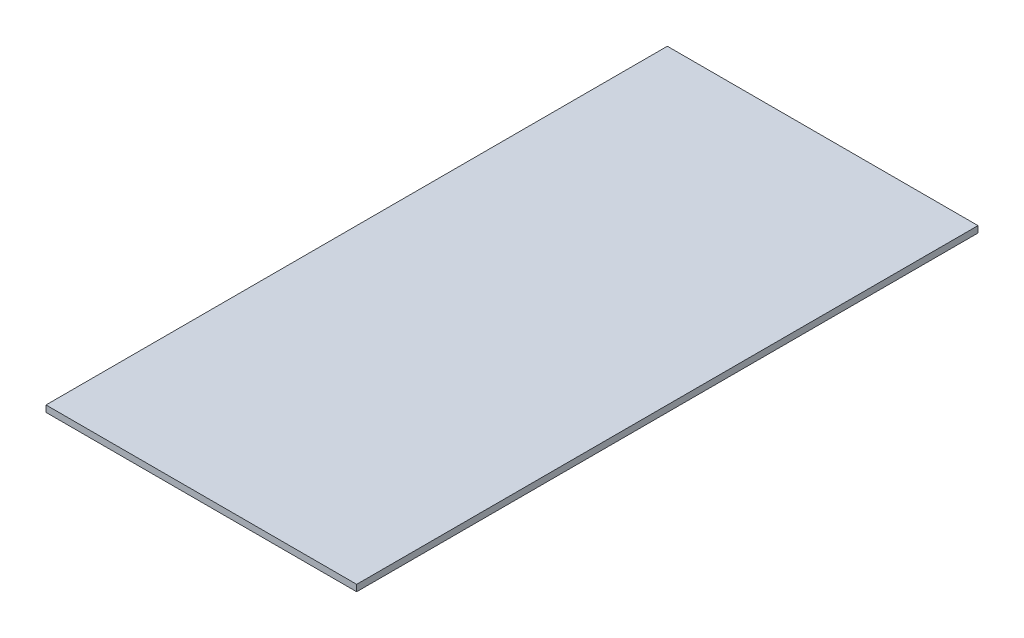
ISO-10303-21;
HEADER;
FILE_DESCRIPTION(('STEP AP214'),'2;1');
FILE_NAME('part.step','',(''),(''),'','','');
FILE_SCHEMA(('AUTOMOTIVE_DESIGN { 1 0 10303 214 1 1 1 1 }'));
ENDSEC;
DATA;
#1=APPLICATION_CONTEXT('core data for automotive mechanical design processes');
#2=APPLICATION_PROTOCOL_DEFINITION('international standard','automotive_design',2000,#1);
#3=PRODUCT_CONTEXT('',#1,'mechanical');
#4=PRODUCT('Part','Part','',(#3));
#5=PRODUCT_RELATED_PRODUCT_CATEGORY('part','',(#4));
#6=PRODUCT_DEFINITION_FORMATION('','',#4);
#7=PRODUCT_DEFINITION_CONTEXT('part definition',#1,'design');
#8=PRODUCT_DEFINITION('design','',#6,#7);
#9=PRODUCT_DEFINITION_SHAPE('','',#8);
#10=(LENGTH_UNIT() NAMED_UNIT(*) SI_UNIT(.MILLI.,.METRE.));
#11=(NAMED_UNIT(*) PLANE_ANGLE_UNIT() SI_UNIT($,.RADIAN.));
#12=(NAMED_UNIT(*) SI_UNIT($,.STERADIAN.) SOLID_ANGLE_UNIT());
#13=UNCERTAINTY_MEASURE_WITH_UNIT(LENGTH_MEASURE(1.E-05),#10,'distance_accuracy_value','');
#14=(GEOMETRIC_REPRESENTATION_CONTEXT(3) GLOBAL_UNCERTAINTY_ASSIGNED_CONTEXT((#13)) GLOBAL_UNIT_ASSIGNED_CONTEXT((#10,
#11,#12)) REPRESENTATION_CONTEXT('',''));
#15=CARTESIAN_POINT('',(0.,0.,0.));
#16=DIRECTION('',(0.,0.,1.));
#17=DIRECTION('',(1.,0.,0.));
#18=AXIS2_PLACEMENT_3D('',#15,#16,#17);
#19=CARTESIAN_POINT('',(609.6,-12.7,-1219.2));
#20=DIRECTION('',(1.,0.,0.));
#21=DIRECTION('',(0.,0.,-1.));
#22=AXIS2_PLACEMENT_3D('',#19,#20,#21);
#23=PLANE('',#22);
#24=DIRECTION('',(0.,0.,-1.));
#25=VECTOR('',#24,1.);
#26=CARTESIAN_POINT('',(609.6,12.7,-1219.2));
#27=LINE('',#26,#25);
#28=CARTESIAN_POINT('',(609.6,12.7,1219.2));
#29=VERTEX_POINT('',#28);
#30=CARTESIAN_POINT('',(609.6,12.7,-1219.2));
#31=VERTEX_POINT('',#30);
#32=EDGE_CURVE('E97',#29,#31,#27,.T.);
#33=ORIENTED_EDGE('',*,*,#32,.F.);
#34=DIRECTION('',(0.,1.,0.));
#35=VECTOR('',#34,1.);
#36=CARTESIAN_POINT('',(609.6,-12.7,1219.2));
#37=LINE('',#36,#35);
#38=CARTESIAN_POINT('',(609.6,-12.7,1219.2));
#39=VERTEX_POINT('',#38);
#40=EDGE_CURVE('E11',#39,#29,#37,.T.);
#41=ORIENTED_EDGE('',*,*,#40,.F.);
#42=DIRECTION('',(0.,0.,-1.));
#43=VECTOR('',#42,1.);
#44=CARTESIAN_POINT('',(609.6,-12.7,-1219.2));
#45=LINE('',#44,#43);
#46=CARTESIAN_POINT('',(609.6,-12.7,-1219.2));
#47=VERTEX_POINT('',#46);
#48=EDGE_CURVE('E91',#39,#47,#45,.T.);
#49=ORIENTED_EDGE('',*,*,#48,.T.);
#50=DIRECTION('',(0.,1.,0.));
#51=VECTOR('',#50,1.);
#52=CARTESIAN_POINT('',(609.6,-12.7,-1219.2));
#53=LINE('',#52,#51);
#54=EDGE_CURVE('E36',#47,#31,#53,.T.);
#55=ORIENTED_EDGE('',*,*,#54,.T.);
#56=EDGE_LOOP('',(#33,#41,#49,#55));
#57=FACE_BOUND('',#56,.T.);
#58=ADVANCED_FACE('F33',(#57),#23,.T.);
#59=CARTESIAN_POINT('',(-609.6,-12.7,1219.2));
#60=DIRECTION('',(0.,0.,1.));
#61=DIRECTION('',(1.,0.,0.));
#62=AXIS2_PLACEMENT_3D('',#59,#60,#61);
#63=PLANE('',#62);
#64=DIRECTION('',(1.,0.,0.));
#65=VECTOR('',#64,1.);
#66=CARTESIAN_POINT('',(-609.6,12.7,1219.2));
#67=LINE('',#66,#65);
#68=CARTESIAN_POINT('',(-609.6,12.7,1219.2));
#69=VERTEX_POINT('',#68);
#70=EDGE_CURVE('E93',#69,#29,#67,.T.);
#71=ORIENTED_EDGE('',*,*,#70,.F.);
#72=DIRECTION('',(0.,1.,0.));
#73=VECTOR('',#72,1.);
#74=CARTESIAN_POINT('',(-609.6,-12.7,1219.2));
#75=LINE('',#74,#73);
#76=CARTESIAN_POINT('',(-609.6,-12.7,1219.2));
#77=VERTEX_POINT('',#76);
#78=EDGE_CURVE('E42',#77,#69,#75,.T.);
#79=ORIENTED_EDGE('',*,*,#78,.F.);
#80=DIRECTION('',(1.,0.,0.));
#81=VECTOR('',#80,1.);
#82=CARTESIAN_POINT('',(-609.6,-12.7,1219.2));
#83=LINE('',#82,#81);
#84=EDGE_CURVE('E88',#77,#39,#83,.T.);
#85=ORIENTED_EDGE('',*,*,#84,.T.);
#86=ORIENTED_EDGE('',*,*,#40,.T.);
#87=EDGE_LOOP('',(#71,#79,#85,#86));
#88=FACE_BOUND('',#87,.T.);
#89=ADVANCED_FACE('F107',(#88),#63,.T.);
#90=CARTESIAN_POINT('',(-609.6,-12.7,-1219.2));
#91=DIRECTION('',(-1.,0.,0.));
#92=DIRECTION('',(0.,0.,1.));
#93=AXIS2_PLACEMENT_3D('',#90,#91,#92);
#94=PLANE('',#93);
#95=DIRECTION('',(0.,0.,1.));
#96=VECTOR('',#95,1.);
#97=CARTESIAN_POINT('',(-609.6,12.7,-1219.2));
#98=LINE('',#97,#96);
#99=CARTESIAN_POINT('',(-609.6,12.7,-1219.2));
#100=VERTEX_POINT('',#99);
#101=EDGE_CURVE('E83',#100,#69,#98,.T.);
#102=ORIENTED_EDGE('',*,*,#101,.F.);
#103=DIRECTION('',(0.,1.,0.));
#104=VECTOR('',#103,1.);
#105=CARTESIAN_POINT('',(-609.6,-12.7,-1219.2));
#106=LINE('',#105,#104);
#107=CARTESIAN_POINT('',(-609.6,-12.7,-1219.2));
#108=VERTEX_POINT('',#107);
#109=EDGE_CURVE('E78',#108,#100,#106,.T.);
#110=ORIENTED_EDGE('',*,*,#109,.F.);
#111=DIRECTION('',(0.,0.,1.));
#112=VECTOR('',#111,1.);
#113=CARTESIAN_POINT('',(-609.6,-12.7,-1219.2));
#114=LINE('',#113,#112);
#115=EDGE_CURVE('E81',#108,#77,#114,.T.);
#116=ORIENTED_EDGE('',*,*,#115,.T.);
#117=ORIENTED_EDGE('',*,*,#78,.T.);
#118=EDGE_LOOP('',(#102,#110,#116,#117));
#119=FACE_BOUND('',#118,.T.);
#120=ADVANCED_FACE('F80',(#119),#94,.T.);
#121=CARTESIAN_POINT('',(-609.6,-12.7,-1219.2));
#122=DIRECTION('',(0.,0.,-1.));
#123=DIRECTION('',(-1.,0.,0.));
#124=AXIS2_PLACEMENT_3D('',#121,#122,#123);
#125=PLANE('',#124);
#126=DIRECTION('',(-1.,0.,0.));
#127=VECTOR('',#126,1.);
#128=CARTESIAN_POINT('',(-609.6,12.7,-1219.2));
#129=LINE('',#128,#127);
#130=EDGE_CURVE('E100',#31,#100,#129,.T.);
#131=ORIENTED_EDGE('',*,*,#130,.F.);
#132=ORIENTED_EDGE('',*,*,#54,.F.);
#133=DIRECTION('',(-1.,0.,0.));
#134=VECTOR('',#133,1.);
#135=CARTESIAN_POINT('',(-609.6,-12.7,-1219.2));
#136=LINE('',#135,#134);
#137=EDGE_CURVE('E87',#47,#108,#136,.T.);
#138=ORIENTED_EDGE('',*,*,#137,.T.);
#139=ORIENTED_EDGE('',*,*,#109,.T.);
#140=EDGE_LOOP('',(#131,#132,#138,#139));
#141=FACE_BOUND('',#140,.T.);
#142=ADVANCED_FACE('F90',(#141),#125,.T.);
#143=CARTESIAN_POINT('',(0.,-12.7,0.));
#144=DIRECTION('',(0.,1.,0.));
#145=DIRECTION('',(0.,0.,1.));
#146=AXIS2_PLACEMENT_3D('',#143,#144,#145);
#147=PLANE('',#146);
#148=ORIENTED_EDGE('',*,*,#48,.F.);
#149=ORIENTED_EDGE('',*,*,#84,.F.);
#150=ORIENTED_EDGE('',*,*,#115,.F.);
#151=ORIENTED_EDGE('',*,*,#137,.F.);
#152=EDGE_LOOP('',(#148,#149,#150,#151));
#153=FACE_BOUND('',#152,.T.);
#154=ADVANCED_FACE('F86',(#153),#147,.F.);
#155=CARTESIAN_POINT('',(0.,12.7,0.));
#156=DIRECTION('',(0.,1.,0.));
#157=DIRECTION('',(0.,0.,1.));
#158=AXIS2_PLACEMENT_3D('',#155,#156,#157);
#159=PLANE('',#158);
#160=ORIENTED_EDGE('',*,*,#32,.T.);
#161=ORIENTED_EDGE('',*,*,#130,.T.);
#162=ORIENTED_EDGE('',*,*,#101,.T.);
#163=ORIENTED_EDGE('',*,*,#70,.T.);
#164=EDGE_LOOP('',(#160,#161,#162,#163));
#165=FACE_BOUND('',#164,.T.);
#166=ADVANCED_FACE('F106',(#165),#159,.T.);
#167=CLOSED_SHELL('',(#58,#89,#120,#142,#154,#166));
#168=MANIFOLD_SOLID_BREP('B2',#167);
#169=ADVANCED_BREP_SHAPE_REPRESENTATION('',(#18,#168),#14);
#170=SHAPE_DEFINITION_REPRESENTATION(#9,#169);
ENDSEC;
END-ISO-10303-21;
